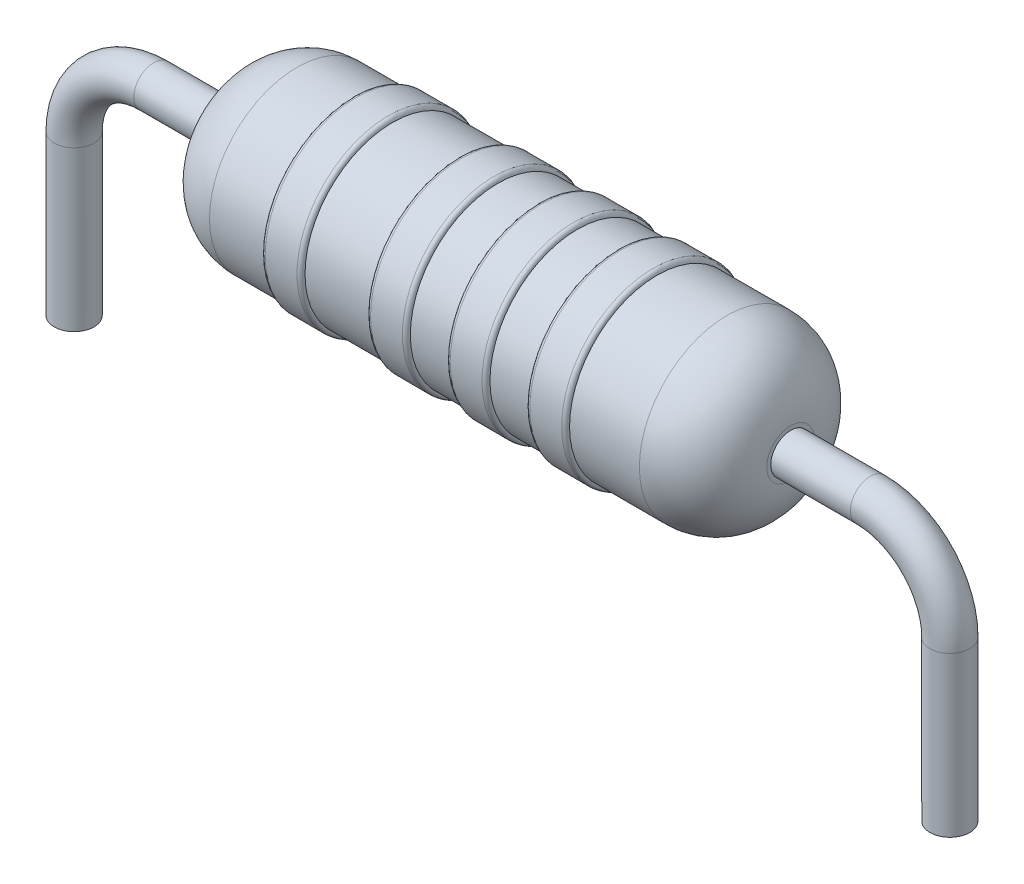
ISO-10303-21;
HEADER;
FILE_DESCRIPTION(('STEP AP214'),'2;1');
FILE_NAME('part.step','',(''),(''),'','','');
FILE_SCHEMA(('AUTOMOTIVE_DESIGN { 1 0 10303 214 1 1 1 1 }'));
ENDSEC;
DATA;
#1=APPLICATION_CONTEXT('core data for automotive mechanical design processes');
#2=APPLICATION_PROTOCOL_DEFINITION('international standard','automotive_design',2000,#1);
#3=PRODUCT_CONTEXT('',#1,'mechanical');
#4=PRODUCT('Part','Part','',(#3));
#5=PRODUCT_RELATED_PRODUCT_CATEGORY('part','',(#4));
#6=PRODUCT_DEFINITION_FORMATION('','',#4);
#7=PRODUCT_DEFINITION_CONTEXT('part definition',#1,'design');
#8=PRODUCT_DEFINITION('design','',#6,#7);
#9=PRODUCT_DEFINITION_SHAPE('','',#8);
#10=(LENGTH_UNIT() NAMED_UNIT(*) SI_UNIT(.MILLI.,.METRE.));
#11=(NAMED_UNIT(*) PLANE_ANGLE_UNIT() SI_UNIT($,.RADIAN.));
#12=(NAMED_UNIT(*) SI_UNIT($,.STERADIAN.) SOLID_ANGLE_UNIT());
#13=UNCERTAINTY_MEASURE_WITH_UNIT(LENGTH_MEASURE(1.E-05),#10,'distance_accuracy_value','');
#14=(GEOMETRIC_REPRESENTATION_CONTEXT(3) GLOBAL_UNCERTAINTY_ASSIGNED_CONTEXT((#13)) GLOBAL_UNIT_ASSIGNED_CONTEXT((#10,
#11,#12)) REPRESENTATION_CONTEXT('',''));
#15=CARTESIAN_POINT('',(0.,0.,0.));
#16=DIRECTION('',(0.,0.,1.));
#17=DIRECTION('',(1.,0.,0.));
#18=AXIS2_PLACEMENT_3D('',#15,#16,#17);
#19=CARTESIAN_POINT('',(-3.5,0.,0.));
#20=DIRECTION('',(1.,0.,0.));
#21=DIRECTION('',(0.,0.,-1.));
#22=AXIS2_PLACEMENT_3D('',#19,#20,#21);
#23=PLANE('',#22);
#24=CARTESIAN_POINT('',(-3.5,0.,0.));
#25=DIRECTION('',(-1.,0.,0.));
#26=DIRECTION('',(0.,0.,1.));
#27=AXIS2_PLACEMENT_3D('',#24,#25,#26);
#28=CIRCLE('',#27,0.299999999999995);
#29=CARTESIAN_POINT('',(-3.5,0.,0.299999999999995));
#30=VERTEX_POINT('',#29);
#31=EDGE_CURVE('E51',#30,#30,#28,.T.);
#32=ORIENTED_EDGE('',*,*,#31,.T.);
#33=EDGE_LOOP('',(#32));
#34=FACE_BOUND('',#33,.T.);
#35=CARTESIAN_POINT('',(-3.5,0.,0.));
#36=DIRECTION('',(-1.,0.,0.));
#37=DIRECTION('',(0.,0.,1.));
#38=AXIS2_PLACEMENT_3D('',#35,#36,#37);
#39=CIRCLE('',#38,0.25);
#40=CARTESIAN_POINT('',(-3.5,0.,0.25));
#41=VERTEX_POINT('',#40);
#42=EDGE_CURVE('E10',#41,#41,#39,.T.);
#43=ORIENTED_EDGE('',*,*,#42,.F.);
#44=EDGE_LOOP('',(#43));
#45=FACE_BOUND('',#44,.T.);
#46=ADVANCED_FACE('F24',(#34,#45),#23,.F.);
#47=CARTESIAN_POINT('',(-54.2686615886834,0.,0.));
#48=DIRECTION('',(-1.,0.,0.));
#49=DIRECTION('',(0.,0.,1.));
#50=AXIS2_PLACEMENT_3D('',#47,#48,#49);
#51=CYLINDRICAL_SURFACE('',#50,1.1);
#52=CARTESIAN_POINT('',(0.322975145638588,0.,0.));
#53=DIRECTION('',(-1.,0.,0.));
#54=DIRECTION('',(0.,0.,1.));
#55=AXIS2_PLACEMENT_3D('',#52,#53,#54);
#56=CIRCLE('',#55,1.1);
#57=CARTESIAN_POINT('',(0.322975145638588,0.,1.1));
#58=VERTEX_POINT('',#57);
#59=EDGE_CURVE('E71',#58,#58,#56,.T.);
#60=ORIENTED_EDGE('',*,*,#59,.T.);
#61=EDGE_LOOP('',(#60));
#62=FACE_BOUND('',#61,.T.);
#63=CARTESIAN_POINT('',(-0.177024854361413,0.,0.));
#64=DIRECTION('',(1.,0.,0.));
#65=DIRECTION('',(0.,0.,-1.));
#66=AXIS2_PLACEMENT_3D('',#63,#64,#65);
#67=CIRCLE('',#66,1.1);
#68=CARTESIAN_POINT('',(-0.177024854361413,0.,-1.1));
#69=VERTEX_POINT('',#68);
#70=EDGE_CURVE('E55',#69,#69,#67,.T.);
#71=ORIENTED_EDGE('',*,*,#70,.T.);
#72=EDGE_LOOP('',(#71));
#73=FACE_BOUND('',#72,.T.);
#74=ADVANCED_FACE('F141',(#62,#73),#51,.T.);
#75=CARTESIAN_POINT('',(4.3261723446646,0.,0.));
#76=DIRECTION('',(1.,0.,0.));
#77=DIRECTION('',(0.,0.,-1.));
#78=AXIS2_PLACEMENT_3D('',#75,#76,#77);
#79=CYLINDRICAL_SURFACE('',#78,1.15);
#80=CARTESIAN_POINT('',(-0.627024854361413,0.,0.));
#81=DIRECTION('',(-1.,0.,0.));
#82=DIRECTION('',(0.,0.,1.));
#83=AXIS2_PLACEMENT_3D('',#80,#81,#82);
#84=CIRCLE('',#83,1.15);
#85=CARTESIAN_POINT('',(-0.627024854361413,0.,1.15));
#86=VERTEX_POINT('',#85);
#87=EDGE_CURVE('E95',#86,#86,#84,.F.);
#88=ORIENTED_EDGE('',*,*,#87,.T.);
#89=EDGE_LOOP('',(#88));
#90=FACE_BOUND('',#89,.T.);
#91=CARTESIAN_POINT('',(-0.227024854361413,0.,0.));
#92=DIRECTION('',(1.,0.,0.));
#93=DIRECTION('',(0.,0.,-1.));
#94=AXIS2_PLACEMENT_3D('',#91,#92,#93);
#95=CIRCLE('',#94,1.15);
#96=CARTESIAN_POINT('',(-0.227024854361413,0.,-1.15));
#97=VERTEX_POINT('',#96);
#98=EDGE_CURVE('E92',#97,#97,#95,.F.);
#99=ORIENTED_EDGE('',*,*,#98,.T.);
#100=EDGE_LOOP('',(#99));
#101=FACE_BOUND('',#100,.T.);
#102=ADVANCED_FACE('F148',(#90,#101),#79,.T.);
#103=CARTESIAN_POINT('',(-1.5,0.,0.));
#104=DIRECTION('',(1.,0.,0.));
#105=DIRECTION('',(0.,0.,-1.));
#106=AXIS2_PLACEMENT_3D('',#103,#104,#105);
#107=CIRCLE('',#106,1.1);
#108=CARTESIAN_POINT('',(-1.5,0.,-1.1));
#109=VERTEX_POINT('',#108);
#110=EDGE_CURVE('E50',#109,#109,#107,.T.);
#111=ORIENTED_EDGE('',*,*,#110,.T.);
#112=EDGE_LOOP('',(#111));
#113=FACE_BOUND('',#112,.T.);
#114=CARTESIAN_POINT('',(-0.677024854361413,0.,0.));
#115=DIRECTION('',(-1.,0.,0.));
#116=DIRECTION('',(0.,0.,1.));
#117=AXIS2_PLACEMENT_3D('',#114,#115,#116);
#118=CIRCLE('',#117,1.1);
#119=CARTESIAN_POINT('',(-0.677024854361413,0.,1.1));
#120=VERTEX_POINT('',#119);
#121=EDGE_CURVE('E65',#120,#120,#118,.T.);
#122=ORIENTED_EDGE('',*,*,#121,.T.);
#123=EDGE_LOOP('',(#122));
#124=FACE_BOUND('',#123,.T.);
#125=ADVANCED_FACE('F150',(#113,#124),#51,.T.);
#126=CARTESIAN_POINT('',(4.3261723446646,0.,0.));
#127=DIRECTION('',(1.,0.,0.));
#128=DIRECTION('',(0.,0.,-1.));
#129=AXIS2_PLACEMENT_3D('',#126,#127,#128);
#130=CYLINDRICAL_SURFACE('',#129,1.15);
#131=CARTESIAN_POINT('',(0.372975145638587,0.,0.));
#132=DIRECTION('',(-1.,0.,0.));
#133=DIRECTION('',(0.,0.,1.));
#134=AXIS2_PLACEMENT_3D('',#131,#132,#133);
#135=CIRCLE('',#134,1.15);
#136=CARTESIAN_POINT('',(0.372975145638587,0.,1.15));
#137=VERTEX_POINT('',#136);
#138=EDGE_CURVE('E101',#137,#137,#135,.F.);
#139=ORIENTED_EDGE('',*,*,#138,.T.);
#140=EDGE_LOOP('',(#139));
#141=FACE_BOUND('',#140,.T.);
#142=CARTESIAN_POINT('',(0.772975145638587,0.,0.));
#143=DIRECTION('',(1.,0.,0.));
#144=DIRECTION('',(0.,0.,-1.));
#145=AXIS2_PLACEMENT_3D('',#142,#143,#144);
#146=CIRCLE('',#145,1.15);
#147=CARTESIAN_POINT('',(0.772975145638587,0.,-1.15));
#148=VERTEX_POINT('',#147);
#149=EDGE_CURVE('E98',#148,#148,#146,.F.);
#150=ORIENTED_EDGE('',*,*,#149,.T.);
#151=EDGE_LOOP('',(#150));
#152=FACE_BOUND('',#151,.T.);
#153=ADVANCED_FACE('F159',(#141,#152),#130,.T.);
#154=CARTESIAN_POINT('',(1.32297514563859,0.,0.));
#155=DIRECTION('',(-1.,0.,0.));
#156=DIRECTION('',(0.,0.,1.));
#157=AXIS2_PLACEMENT_3D('',#154,#155,#156);
#158=CIRCLE('',#157,1.1);
#159=CARTESIAN_POINT('',(1.32297514563859,0.,1.1));
#160=VERTEX_POINT('',#159);
#161=EDGE_CURVE('E77',#160,#160,#158,.T.);
#162=ORIENTED_EDGE('',*,*,#161,.T.);
#163=EDGE_LOOP('',(#162));
#164=FACE_BOUND('',#163,.T.);
#165=CARTESIAN_POINT('',(0.822975145638588,0.,0.));
#166=DIRECTION('',(1.,0.,0.));
#167=DIRECTION('',(0.,0.,-1.));
#168=AXIS2_PLACEMENT_3D('',#165,#166,#167);
#169=CIRCLE('',#168,1.1);
#170=CARTESIAN_POINT('',(0.822975145638588,0.,-1.1));
#171=VERTEX_POINT('',#170);
#172=EDGE_CURVE('E68',#171,#171,#169,.T.);
#173=ORIENTED_EDGE('',*,*,#172,.T.);
#174=EDGE_LOOP('',(#173));
#175=FACE_BOUND('',#174,.T.);
#176=ADVANCED_FACE('F122',(#164,#175),#51,.T.);
#177=CARTESIAN_POINT('',(4.3261723446646,0.,0.));
#178=DIRECTION('',(1.,0.,0.));
#179=DIRECTION('',(0.,0.,-1.));
#180=AXIS2_PLACEMENT_3D('',#177,#178,#179);
#181=CYLINDRICAL_SURFACE('',#180,1.15);
#182=CARTESIAN_POINT('',(1.37297514563859,0.,0.));
#183=DIRECTION('',(-1.,0.,0.));
#184=DIRECTION('',(0.,0.,1.));
#185=AXIS2_PLACEMENT_3D('',#182,#183,#184);
#186=CIRCLE('',#185,1.15);
#187=CARTESIAN_POINT('',(1.37297514563859,0.,1.15));
#188=VERTEX_POINT('',#187);
#189=EDGE_CURVE('E28',#188,#188,#186,.F.);
#190=ORIENTED_EDGE('',*,*,#189,.T.);
#191=EDGE_LOOP('',(#190));
#192=FACE_BOUND('',#191,.T.);
#193=CARTESIAN_POINT('',(1.77297514563859,0.,0.));
#194=DIRECTION('',(1.,0.,0.));
#195=DIRECTION('',(0.,0.,-1.));
#196=AXIS2_PLACEMENT_3D('',#193,#194,#195);
#197=CIRCLE('',#196,1.15);
#198=CARTESIAN_POINT('',(1.77297514563859,0.,-1.15));
#199=VERTEX_POINT('',#198);
#200=EDGE_CURVE('E36',#199,#199,#197,.F.);
#201=ORIENTED_EDGE('',*,*,#200,.T.);
#202=EDGE_LOOP('',(#201));
#203=FACE_BOUND('',#202,.T.);
#204=ADVANCED_FACE('F106',(#192,#203),#181,.T.);
#205=CARTESIAN_POINT('',(3.5,0.299999999999995,0.));
#206=DIRECTION('',(-1.,0.,0.));
#207=DIRECTION('',(0.,0.,1.));
#208=AXIS2_PLACEMENT_3D('',#205,#206,#207);
#209=PLANE('',#208);
#210=CARTESIAN_POINT('',(3.5,0.,0.));
#211=DIRECTION('',(-1.,0.,0.));
#212=DIRECTION('',(0.,0.,1.));
#213=AXIS2_PLACEMENT_3D('',#210,#211,#212);
#214=CIRCLE('',#213,0.25);
#215=CARTESIAN_POINT('',(3.5,0.,0.25));
#216=VERTEX_POINT('',#215);
#217=EDGE_CURVE('E254',#216,#216,#214,.T.);
#218=ORIENTED_EDGE('',*,*,#217,.T.);
#219=EDGE_LOOP('',(#218));
#220=FACE_BOUND('',#219,.T.);
#221=CARTESIAN_POINT('',(3.5,0.,0.));
#222=DIRECTION('',(-1.,0.,0.));
#223=DIRECTION('',(0.,0.,1.));
#224=AXIS2_PLACEMENT_3D('',#221,#222,#223);
#225=CIRCLE('',#224,0.299999999999995);
#226=CARTESIAN_POINT('',(3.5,0.,0.299999999999995));
#227=VERTEX_POINT('',#226);
#228=EDGE_CURVE('E61',#227,#227,#225,.T.);
#229=ORIENTED_EDGE('',*,*,#228,.F.);
#230=EDGE_LOOP('',(#229));
#231=FACE_BOUND('',#230,.T.);
#232=ADVANCED_FACE('F26',(#220,#231),#209,.F.);
#233=CARTESIAN_POINT('',(2.7,0.,0.));
#234=DIRECTION('',(-1.,0.,0.));
#235=DIRECTION('',(0.,0.,1.));
#236=AXIS2_PLACEMENT_3D('',#233,#234,#235);
#237=DEGENERATE_TOROIDAL_SURFACE('',#236,0.3,0.8,.T.);
#238=CARTESIAN_POINT('',(2.69999999999999,0.,0.));
#239=DIRECTION('',(-1.,0.,0.));
#240=DIRECTION('',(0.,0.,1.));
#241=AXIS2_PLACEMENT_3D('',#238,#239,#240);
#242=CIRCLE('',#241,1.1);
#243=CARTESIAN_POINT('',(2.69999999999999,0.,1.1));
#244=VERTEX_POINT('',#243);
#245=EDGE_CURVE('E58',#244,#244,#242,.T.);
#246=ORIENTED_EDGE('',*,*,#245,.F.);
#247=EDGE_LOOP('',(#246));
#248=FACE_BOUND('',#247,.T.);
#249=ORIENTED_EDGE('',*,*,#228,.T.);
#250=EDGE_LOOP('',(#249));
#251=FACE_BOUND('',#250,.T.);
#252=ADVANCED_FACE('F120',(#248,#251),#237,.T.);
#253=CARTESIAN_POINT('',(1.82297514563859,0.,0.));
#254=DIRECTION('',(1.,0.,0.));
#255=DIRECTION('',(0.,0.,-1.));
#256=AXIS2_PLACEMENT_3D('',#253,#254,#255);
#257=CIRCLE('',#256,1.1);
#258=CARTESIAN_POINT('',(1.82297514563859,0.,-1.1));
#259=VERTEX_POINT('',#258);
#260=EDGE_CURVE('E74',#259,#259,#257,.T.);
#261=ORIENTED_EDGE('',*,*,#260,.T.);
#262=EDGE_LOOP('',(#261));
#263=FACE_BOUND('',#262,.T.);
#264=ORIENTED_EDGE('',*,*,#245,.T.);
#265=EDGE_LOOP('',(#264));
#266=FACE_BOUND('',#265,.T.);
#267=ADVANCED_FACE('F116',(#263,#266),#51,.T.);
#268=CARTESIAN_POINT('',(4.3261723446646,0.,0.));
#269=DIRECTION('',(1.,0.,0.));
#270=DIRECTION('',(0.,0.,-1.));
#271=AXIS2_PLACEMENT_3D('',#268,#269,#270);
#272=CYLINDRICAL_SURFACE('',#271,1.15);
#273=CARTESIAN_POINT('',(-1.95,0.,0.));
#274=DIRECTION('',(-1.,0.,0.));
#275=DIRECTION('',(0.,0.,1.));
#276=AXIS2_PLACEMENT_3D('',#273,#274,#275);
#277=CIRCLE('',#276,1.15);
#278=CARTESIAN_POINT('',(-1.95,0.,1.15));
#279=VERTEX_POINT('',#278);
#280=EDGE_CURVE('E89',#279,#279,#277,.F.);
#281=ORIENTED_EDGE('',*,*,#280,.T.);
#282=EDGE_LOOP('',(#281));
#283=FACE_BOUND('',#282,.T.);
#284=CARTESIAN_POINT('',(-1.55,0.,0.));
#285=DIRECTION('',(1.,0.,0.));
#286=DIRECTION('',(0.,0.,-1.));
#287=AXIS2_PLACEMENT_3D('',#284,#285,#286);
#288=CIRCLE('',#287,1.15);
#289=CARTESIAN_POINT('',(-1.55,0.,-1.15));
#290=VERTEX_POINT('',#289);
#291=EDGE_CURVE('E64',#290,#290,#288,.F.);
#292=ORIENTED_EDGE('',*,*,#291,.T.);
#293=EDGE_LOOP('',(#292));
#294=FACE_BOUND('',#293,.T.);
#295=ADVANCED_FACE('F119',(#283,#294),#272,.T.);
#296=CARTESIAN_POINT('',(-2.7,0.,0.));
#297=DIRECTION('',(-1.,0.,0.));
#298=DIRECTION('',(0.,0.,1.));
#299=AXIS2_PLACEMENT_3D('',#296,#297,#298);
#300=DEGENERATE_TOROIDAL_SURFACE('',#299,0.3,0.8,.T.);
#301=ORIENTED_EDGE('',*,*,#31,.F.);
#302=EDGE_LOOP('',(#301));
#303=FACE_BOUND('',#302,.T.);
#304=CARTESIAN_POINT('',(-2.69999999999999,0.,0.));
#305=DIRECTION('',(-1.,0.,0.));
#306=DIRECTION('',(0.,0.,1.));
#307=AXIS2_PLACEMENT_3D('',#304,#305,#306);
#308=CIRCLE('',#307,1.1);
#309=CARTESIAN_POINT('',(-2.69999999999999,0.,1.1));
#310=VERTEX_POINT('',#309);
#311=EDGE_CURVE('E54',#310,#310,#308,.T.);
#312=ORIENTED_EDGE('',*,*,#311,.T.);
#313=EDGE_LOOP('',(#312));
#314=FACE_BOUND('',#313,.T.);
#315=ADVANCED_FACE('F155',(#303,#314),#300,.T.);
#316=CARTESIAN_POINT('',(-2.,0.,0.));
#317=DIRECTION('',(-1.,0.,0.));
#318=DIRECTION('',(0.,0.,1.));
#319=AXIS2_PLACEMENT_3D('',#316,#317,#318);
#320=CIRCLE('',#319,1.1);
#321=CARTESIAN_POINT('',(-2.,0.,1.1));
#322=VERTEX_POINT('',#321);
#323=EDGE_CURVE('E80',#322,#322,#320,.T.);
#324=ORIENTED_EDGE('',*,*,#323,.T.);
#325=EDGE_LOOP('',(#324));
#326=FACE_BOUND('',#325,.T.);
#327=ORIENTED_EDGE('',*,*,#311,.F.);
#328=EDGE_LOOP('',(#327));
#329=FACE_BOUND('',#328,.T.);
#330=ADVANCED_FACE('F123',(#326,#329),#51,.T.);
#331=CARTESIAN_POINT('',(-1.95,0.,0.));
#332=DIRECTION('',(-1.,0.,0.));
#333=DIRECTION('',(0.,0.,1.));
#334=AXIS2_PLACEMENT_3D('',#331,#332,#333);
#335=TOROIDAL_SURFACE('',#334,1.1,0.05);
#336=ORIENTED_EDGE('',*,*,#323,.F.);
#337=EDGE_LOOP('',(#336));
#338=FACE_BOUND('',#337,.T.);
#339=ORIENTED_EDGE('',*,*,#280,.F.);
#340=EDGE_LOOP('',(#339));
#341=FACE_BOUND('',#340,.T.);
#342=ADVANCED_FACE('F170',(#338,#341),#335,.T.);
#343=CARTESIAN_POINT('',(-1.55,0.,0.));
#344=DIRECTION('',(1.,0.,0.));
#345=DIRECTION('',(0.,0.,-1.));
#346=AXIS2_PLACEMENT_3D('',#343,#344,#345);
#347=TOROIDAL_SURFACE('',#346,1.1,0.05);
#348=ORIENTED_EDGE('',*,*,#291,.F.);
#349=EDGE_LOOP('',(#348));
#350=FACE_BOUND('',#349,.T.);
#351=ORIENTED_EDGE('',*,*,#110,.F.);
#352=EDGE_LOOP('',(#351));
#353=FACE_BOUND('',#352,.T.);
#354=ADVANCED_FACE('F175',(#350,#353),#347,.T.);
#355=CARTESIAN_POINT('',(-0.627024854361413,0.,0.));
#356=DIRECTION('',(-1.,0.,0.));
#357=DIRECTION('',(0.,0.,1.));
#358=AXIS2_PLACEMENT_3D('',#355,#356,#357);
#359=TOROIDAL_SURFACE('',#358,1.1,0.05);
#360=ORIENTED_EDGE('',*,*,#121,.F.);
#361=EDGE_LOOP('',(#360));
#362=FACE_BOUND('',#361,.T.);
#363=ORIENTED_EDGE('',*,*,#87,.F.);
#364=EDGE_LOOP('',(#363));
#365=FACE_BOUND('',#364,.T.);
#366=ADVANCED_FACE('F192',(#362,#365),#359,.T.);
#367=CARTESIAN_POINT('',(-0.227024854361413,0.,0.));
#368=DIRECTION('',(1.,0.,0.));
#369=DIRECTION('',(0.,0.,-1.));
#370=AXIS2_PLACEMENT_3D('',#367,#368,#369);
#371=TOROIDAL_SURFACE('',#370,1.1,0.05);
#372=ORIENTED_EDGE('',*,*,#98,.F.);
#373=EDGE_LOOP('',(#372));
#374=FACE_BOUND('',#373,.T.);
#375=ORIENTED_EDGE('',*,*,#70,.F.);
#376=EDGE_LOOP('',(#375));
#377=FACE_BOUND('',#376,.T.);
#378=ADVANCED_FACE('F198',(#374,#377),#371,.T.);
#379=CARTESIAN_POINT('',(0.372975145638587,0.,0.));
#380=DIRECTION('',(-1.,0.,0.));
#381=DIRECTION('',(0.,0.,1.));
#382=AXIS2_PLACEMENT_3D('',#379,#380,#381);
#383=TOROIDAL_SURFACE('',#382,1.1,0.05);
#384=ORIENTED_EDGE('',*,*,#59,.F.);
#385=EDGE_LOOP('',(#384));
#386=FACE_BOUND('',#385,.T.);
#387=ORIENTED_EDGE('',*,*,#138,.F.);
#388=EDGE_LOOP('',(#387));
#389=FACE_BOUND('',#388,.T.);
#390=ADVANCED_FACE('F204',(#386,#389),#383,.T.);
#391=CARTESIAN_POINT('',(0.772975145638587,0.,0.));
#392=DIRECTION('',(1.,0.,0.));
#393=DIRECTION('',(0.,0.,-1.));
#394=AXIS2_PLACEMENT_3D('',#391,#392,#393);
#395=TOROIDAL_SURFACE('',#394,1.1,0.05);
#396=ORIENTED_EDGE('',*,*,#149,.F.);
#397=EDGE_LOOP('',(#396));
#398=FACE_BOUND('',#397,.T.);
#399=ORIENTED_EDGE('',*,*,#172,.F.);
#400=EDGE_LOOP('',(#399));
#401=FACE_BOUND('',#400,.T.);
#402=ADVANCED_FACE('F208',(#398,#401),#395,.T.);
#403=CARTESIAN_POINT('',(1.37297514563859,0.,0.));
#404=DIRECTION('',(-1.,0.,0.));
#405=DIRECTION('',(0.,0.,1.));
#406=AXIS2_PLACEMENT_3D('',#403,#404,#405);
#407=TOROIDAL_SURFACE('',#406,1.1,0.05);
#408=ORIENTED_EDGE('',*,*,#161,.F.);
#409=EDGE_LOOP('',(#408));
#410=FACE_BOUND('',#409,.T.);
#411=ORIENTED_EDGE('',*,*,#189,.F.);
#412=EDGE_LOOP('',(#411));
#413=FACE_BOUND('',#412,.T.);
#414=ADVANCED_FACE('F112',(#410,#413),#407,.T.);
#415=CARTESIAN_POINT('',(1.77297514563859,0.,0.));
#416=DIRECTION('',(1.,0.,0.));
#417=DIRECTION('',(0.,0.,-1.));
#418=AXIS2_PLACEMENT_3D('',#415,#416,#417);
#419=TOROIDAL_SURFACE('',#418,1.1,0.05);
#420=ORIENTED_EDGE('',*,*,#200,.F.);
#421=EDGE_LOOP('',(#420));
#422=FACE_BOUND('',#421,.T.);
#423=ORIENTED_EDGE('',*,*,#260,.F.);
#424=EDGE_LOOP('',(#423));
#425=FACE_BOUND('',#424,.T.);
#426=ADVANCED_FACE('F108',(#422,#425),#419,.T.);
#427=CARTESIAN_POINT('',(-5.5,-1.00000000000001,0.));
#428=DIRECTION('',(0.,-1.,0.));
#429=DIRECTION('',(0.,0.,-1.));
#430=AXIS2_PLACEMENT_3D('',#427,#428,#429);
#431=CYLINDRICAL_SURFACE('',#430,0.25);
#432=CARTESIAN_POINT('',(-5.5,-1.00000000000001,0.));
#433=DIRECTION('',(0.,-1.,0.));
#434=DIRECTION('',(0.,0.,1.));
#435=AXIS2_PLACEMENT_3D('',#432,#433,#434);
#436=CIRCLE('',#435,0.25);
#437=CARTESIAN_POINT('',(-5.75,-1.00000000000001,0.));
#438=VERTEX_POINT('',#437);
#439=EDGE_CURVE('E44',#438,#438,#436,.T.);
#440=ORIENTED_EDGE('',*,*,#439,.T.);
#441=EDGE_LOOP('',(#440));
#442=FACE_BOUND('',#441,.T.);
#443=CARTESIAN_POINT('',(-5.5,-3.,0.));
#444=DIRECTION('',(0.,-1.,0.));
#445=DIRECTION('',(0.,0.,1.));
#446=AXIS2_PLACEMENT_3D('',#443,#444,#445);
#447=CIRCLE('',#446,0.25);
#448=CARTESIAN_POINT('',(-5.5,-3.,0.25));
#449=VERTEX_POINT('',#448);
#450=EDGE_CURVE('E47',#449,#449,#447,.T.);
#451=ORIENTED_EDGE('',*,*,#450,.F.);
#452=EDGE_LOOP('',(#451));
#453=FACE_BOUND('',#452,.T.);
#454=ADVANCED_FACE('F111',(#442,#453),#431,.T.);
#455=CARTESIAN_POINT('',(-4.5,-1.,0.));
#456=DIRECTION('',(0.,0.,1.));
#457=DIRECTION('',(1.,0.,0.));
#458=AXIS2_PLACEMENT_3D('',#455,#456,#457);
#459=TOROIDAL_SURFACE('',#458,1.,0.25);
#460=CARTESIAN_POINT('',(-4.49999999999999,0.,0.));
#461=DIRECTION('',(-1.,0.,0.));
#462=DIRECTION('',(0.,0.,1.));
#463=AXIS2_PLACEMENT_3D('',#460,#461,#462);
#464=CIRCLE('',#463,0.25);
#465=CARTESIAN_POINT('',(-4.49999999999999,0.25,0.));
#466=VERTEX_POINT('',#465);
#467=EDGE_CURVE('E41',#466,#466,#464,.T.);
#468=CARTESIAN_POINT('',(-4.5,-1.,0.));
#469=DIRECTION('',(0.,0.,1.));
#470=DIRECTION('',(1.,0.,0.));
#471=AXIS2_PLACEMENT_3D('',#468,#469,#470);
#472=CIRCLE('',#471,1.25);
#473=EDGE_CURVE('',#466,#438,#472,.T.);
#474=ORIENTED_EDGE('',*,*,#467,.T.);
#475=ORIENTED_EDGE('',*,*,#439,.F.);
#476=ORIENTED_EDGE('',*,*,#473,.T.);
#477=ORIENTED_EDGE('',*,*,#473,.F.);
#478=EDGE_LOOP('',(#474,#476,#475,#477));
#479=FACE_BOUND('',#478,.T.);
#480=ADVANCED_FACE('F217',(#479),#459,.T.);
#481=CARTESIAN_POINT('',(-4.49999999999999,0.,0.));
#482=DIRECTION('',(1.,0.,0.));
#483=DIRECTION('',(0.,0.,-1.));
#484=AXIS2_PLACEMENT_3D('',#481,#482,#483);
#485=CYLINDRICAL_SURFACE('',#484,0.25);
#486=ORIENTED_EDGE('',*,*,#467,.F.);
#487=EDGE_LOOP('',(#486));
#488=FACE_BOUND('',#487,.T.);
#489=ORIENTED_EDGE('',*,*,#42,.T.);
#490=EDGE_LOOP('',(#489));
#491=FACE_BOUND('',#490,.T.);
#492=ADVANCED_FACE('F221',(#488,#491),#485,.T.);
#493=CARTESIAN_POINT('',(-5.5,-3.,0.));
#494=DIRECTION('',(0.,-1.,0.));
#495=DIRECTION('',(0.,0.,1.));
#496=AXIS2_PLACEMENT_3D('',#493,#494,#495);
#497=PLANE('',#496);
#498=ORIENTED_EDGE('',*,*,#450,.T.);
#499=EDGE_LOOP('',(#498));
#500=FACE_BOUND('',#499,.T.);
#501=ADVANCED_FACE('F225',(#500),#497,.T.);
#502=CARTESIAN_POINT('',(5.5,-1.00000000000001,0.));
#503=DIRECTION('',(0.,-1.,0.));
#504=DIRECTION('',(0.,0.,-1.));
#505=AXIS2_PLACEMENT_3D('',#502,#503,#504);
#506=CYLINDRICAL_SURFACE('',#505,0.25);
#507=CARTESIAN_POINT('',(5.5,-1.00000000000001,0.));
#508=DIRECTION('',(0.,1.,0.));
#509=DIRECTION('',(0.,0.,1.));
#510=AXIS2_PLACEMENT_3D('',#507,#508,#509);
#511=CIRCLE('',#510,0.25);
#512=CARTESIAN_POINT('',(5.75,-1.00000000000001,0.));
#513=VERTEX_POINT('',#512);
#514=EDGE_CURVE('E248',#513,#513,#511,.T.);
#515=ORIENTED_EDGE('',*,*,#514,.F.);
#516=EDGE_LOOP('',(#515));
#517=FACE_BOUND('',#516,.T.);
#518=CARTESIAN_POINT('',(5.5,-3.,0.));
#519=DIRECTION('',(0.,1.,0.));
#520=DIRECTION('',(0.,0.,1.));
#521=AXIS2_PLACEMENT_3D('',#518,#519,#520);
#522=CIRCLE('',#521,0.25);
#523=CARTESIAN_POINT('',(5.5,-3.,0.25));
#524=VERTEX_POINT('',#523);
#525=EDGE_CURVE('E39',#524,#524,#522,.T.);
#526=ORIENTED_EDGE('',*,*,#525,.T.);
#527=EDGE_LOOP('',(#526));
#528=FACE_BOUND('',#527,.T.);
#529=ADVANCED_FACE('F228',(#517,#528),#506,.T.);
#530=CARTESIAN_POINT('',(4.5,-1.,0.));
#531=DIRECTION('',(0.,0.,-1.));
#532=DIRECTION('',(-1.,0.,0.));
#533=AXIS2_PLACEMENT_3D('',#530,#531,#532);
#534=TOROIDAL_SURFACE('',#533,1.,0.25);
#535=CARTESIAN_POINT('',(4.49999999999999,0.,0.));
#536=DIRECTION('',(-1.,0.,0.));
#537=DIRECTION('',(0.,0.,1.));
#538=AXIS2_PLACEMENT_3D('',#535,#536,#537);
#539=CIRCLE('',#538,0.25);
#540=CARTESIAN_POINT('',(4.49999999999999,0.25,0.));
#541=VERTEX_POINT('',#540);
#542=EDGE_CURVE('E250',#541,#541,#539,.T.);
#543=CARTESIAN_POINT('',(4.5,-1.,0.));
#544=DIRECTION('',(0.,0.,-1.));
#545=DIRECTION('',(-1.,0.,0.));
#546=AXIS2_PLACEMENT_3D('',#543,#544,#545);
#547=CIRCLE('',#546,1.25);
#548=EDGE_CURVE('',#541,#513,#547,.T.);
#549=ORIENTED_EDGE('',*,*,#542,.F.);
#550=ORIENTED_EDGE('',*,*,#514,.T.);
#551=ORIENTED_EDGE('',*,*,#548,.T.);
#552=ORIENTED_EDGE('',*,*,#548,.F.);
#553=EDGE_LOOP('',(#549,#551,#550,#552));
#554=FACE_BOUND('',#553,.T.);
#555=ADVANCED_FACE('F231',(#554),#534,.T.);
#556=CARTESIAN_POINT('',(4.49999999999999,0.,0.));
#557=DIRECTION('',(-1.,0.,0.));
#558=DIRECTION('',(0.,0.,1.));
#559=AXIS2_PLACEMENT_3D('',#556,#557,#558);
#560=CYLINDRICAL_SURFACE('',#559,0.25);
#561=ORIENTED_EDGE('',*,*,#542,.T.);
#562=EDGE_LOOP('',(#561));
#563=FACE_BOUND('',#562,.T.);
#564=ORIENTED_EDGE('',*,*,#217,.F.);
#565=EDGE_LOOP('',(#564));
#566=FACE_BOUND('',#565,.T.);
#567=ADVANCED_FACE('F235',(#563,#566),#560,.T.);
#568=CARTESIAN_POINT('',(5.5,-3.,0.));
#569=DIRECTION('',(0.,-1.,0.));
#570=DIRECTION('',(0.,0.,1.));
#571=AXIS2_PLACEMENT_3D('',#568,#569,#570);
#572=PLANE('',#571);
#573=ORIENTED_EDGE('',*,*,#525,.F.);
#574=EDGE_LOOP('',(#573));
#575=FACE_BOUND('',#574,.T.);
#576=ADVANCED_FACE('F239',(#575),#572,.T.);
#577=CLOSED_SHELL('',(#46,#74,#102,#125,#153,#176,#204,#232,#252,#267,#295,#315,#330,#342,#354,
#366,#378,#390,#402,#414,#426,#454,#480,#492,#501,#529,#555,#567,#576));
#578=MANIFOLD_SOLID_BREP('B2',#577);
#579=ADVANCED_BREP_SHAPE_REPRESENTATION('',(#18,#578),#14);
#580=SHAPE_DEFINITION_REPRESENTATION(#9,#579);
ENDSEC;
END-ISO-10303-21;
